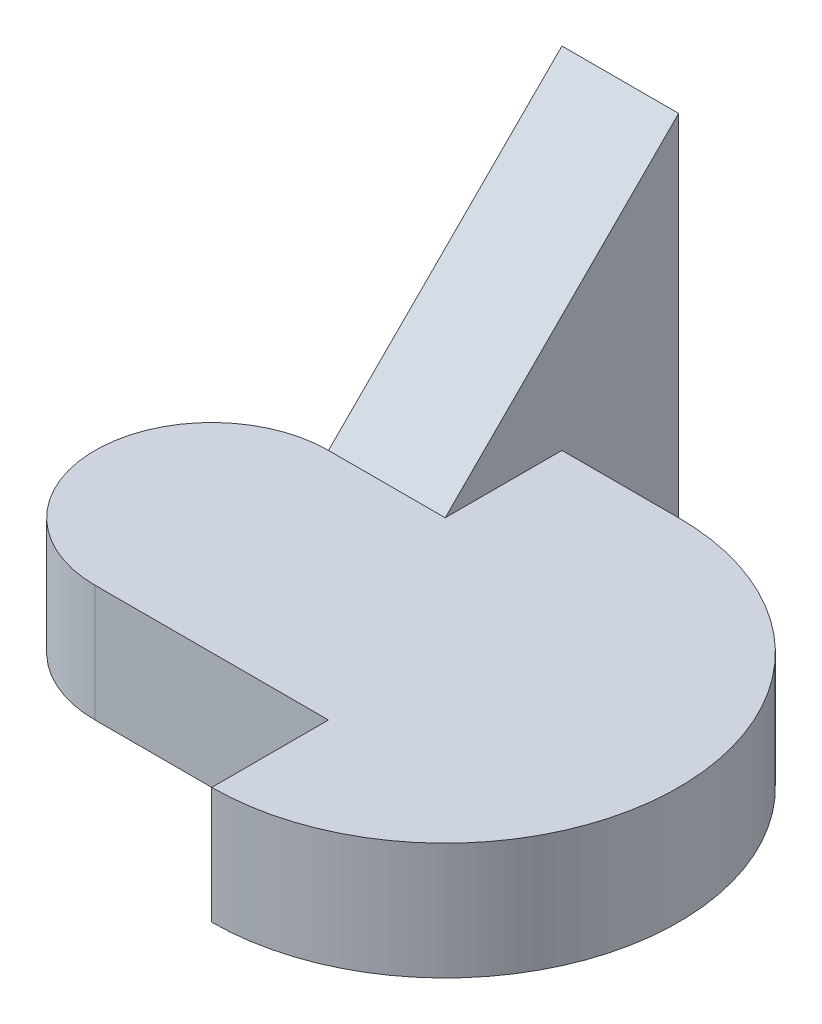
ISO-10303-21;
HEADER;
FILE_DESCRIPTION(('STEP AP214'),'2;1');
FILE_NAME('part.step','',(''),(''),'','','');
FILE_SCHEMA(('AUTOMOTIVE_DESIGN { 1 0 10303 214 1 1 1 1 }'));
ENDSEC;
DATA;
#1=APPLICATION_CONTEXT('core data for automotive mechanical design processes');
#2=APPLICATION_PROTOCOL_DEFINITION('international standard','automotive_design',2000,#1);
#3=PRODUCT_CONTEXT('',#1,'mechanical');
#4=PRODUCT('Part','Part','',(#3));
#5=PRODUCT_RELATED_PRODUCT_CATEGORY('part','',(#4));
#6=PRODUCT_DEFINITION_FORMATION('','',#4);
#7=PRODUCT_DEFINITION_CONTEXT('part definition',#1,'design');
#8=PRODUCT_DEFINITION('design','',#6,#7);
#9=PRODUCT_DEFINITION_SHAPE('','',#8);
#10=(LENGTH_UNIT() NAMED_UNIT(*) SI_UNIT(.MILLI.,.METRE.));
#11=(NAMED_UNIT(*) PLANE_ANGLE_UNIT() SI_UNIT($,.RADIAN.));
#12=(NAMED_UNIT(*) SI_UNIT($,.STERADIAN.) SOLID_ANGLE_UNIT());
#13=UNCERTAINTY_MEASURE_WITH_UNIT(LENGTH_MEASURE(1.E-05),#10,'distance_accuracy_value','');
#14=(GEOMETRIC_REPRESENTATION_CONTEXT(3) GLOBAL_UNCERTAINTY_ASSIGNED_CONTEXT((#13)) GLOBAL_UNIT_ASSIGNED_CONTEXT((#10,
#11,#12)) REPRESENTATION_CONTEXT('',''));
#15=CARTESIAN_POINT('',(0.,0.,0.));
#16=DIRECTION('',(0.,0.,1.));
#17=DIRECTION('',(1.,0.,0.));
#18=AXIS2_PLACEMENT_3D('',#15,#16,#17);
#19=CARTESIAN_POINT('',(0.,5.,0.));
#20=DIRECTION('',(1.,0.,0.));
#21=DIRECTION('',(0.,0.,-1.));
#22=AXIS2_PLACEMENT_3D('',#19,#20,#21);
#23=PLANE('',#22);
#24=DIRECTION('',(0.,0.,1.));
#25=VECTOR('',#24,1.);
#26=CARTESIAN_POINT('',(0.,0.,0.));
#27=LINE('',#26,#25);
#28=CARTESIAN_POINT('',(0.,0.,5.));
#29=VERTEX_POINT('',#28);
#30=CARTESIAN_POINT('',(0.,0.,10.));
#31=VERTEX_POINT('',#30);
#32=EDGE_CURVE('E132',#29,#31,#27,.T.);
#33=ORIENTED_EDGE('',*,*,#32,.T.);
#34=DIRECTION('',(0.,-1.,0.));
#35=VECTOR('',#34,1.);
#36=CARTESIAN_POINT('',(0.,5.,10.));
#37=LINE('',#36,#35);
#38=CARTESIAN_POINT('',(0.,5.,10.));
#39=VERTEX_POINT('',#38);
#40=EDGE_CURVE('E11',#39,#31,#37,.T.);
#41=ORIENTED_EDGE('',*,*,#40,.F.);
#42=DIRECTION('',(0.,0.,1.));
#43=VECTOR('',#42,1.);
#44=CARTESIAN_POINT('',(0.,5.,0.));
#45=LINE('',#44,#43);
#46=CARTESIAN_POINT('',(0.,5.,5.));
#47=VERTEX_POINT('',#46);
#48=EDGE_CURVE('E141',#47,#39,#45,.T.);
#49=ORIENTED_EDGE('',*,*,#48,.F.);
#50=DIRECTION('',(0.,-1.,0.));
#51=VECTOR('',#50,1.);
#52=CARTESIAN_POINT('',(0.,5.,5.));
#53=LINE('',#52,#51);
#54=EDGE_CURVE('E131',#47,#29,#53,.T.);
#55=ORIENTED_EDGE('',*,*,#54,.T.);
#56=EDGE_LOOP('',(#33,#41,#49,#55));
#57=FACE_BOUND('',#56,.T.);
#58=ADVANCED_FACE('F39',(#57),#23,.F.);
#59=CARTESIAN_POINT('',(0.,5.,0.));
#60=DIRECTION('',(0.,-1.,0.));
#61=DIRECTION('',(0.,0.,-1.));
#62=AXIS2_PLACEMENT_3D('',#59,#60,#61);
#63=CYLINDRICAL_SURFACE('',#62,10.);
#64=CARTESIAN_POINT('',(0.,0.,0.));
#65=DIRECTION('',(0.,1.,0.));
#66=DIRECTION('',(0.,0.,1.));
#67=AXIS2_PLACEMENT_3D('',#64,#65,#66);
#68=CIRCLE('',#67,10.);
#69=CARTESIAN_POINT('',(0.,0.,-10.));
#70=VERTEX_POINT('',#69);
#71=EDGE_CURVE('E135',#31,#70,#68,.T.);
#72=ORIENTED_EDGE('',*,*,#71,.T.);
#73=DIRECTION('',(0.,-1.,0.));
#74=VECTOR('',#73,1.);
#75=CARTESIAN_POINT('',(0.,5.,-10.));
#76=LINE('',#75,#74);
#77=CARTESIAN_POINT('',(0.,5.,-10.));
#78=VERTEX_POINT('',#77);
#79=EDGE_CURVE('E47',#78,#70,#76,.T.);
#80=ORIENTED_EDGE('',*,*,#79,.F.);
#81=CARTESIAN_POINT('',(0.,5.,0.));
#82=DIRECTION('',(0.,1.,0.));
#83=DIRECTION('',(0.,0.,1.));
#84=AXIS2_PLACEMENT_3D('',#81,#82,#83);
#85=CIRCLE('',#84,10.);
#86=EDGE_CURVE('E90',#39,#78,#85,.T.);
#87=ORIENTED_EDGE('',*,*,#86,.F.);
#88=ORIENTED_EDGE('',*,*,#40,.T.);
#89=EDGE_LOOP('',(#72,#80,#87,#88));
#90=FACE_BOUND('',#89,.T.);
#91=ADVANCED_FACE('F171',(#90),#63,.T.);
#92=CARTESIAN_POINT('',(0.,5.,-10.));
#93=DIRECTION('',(0.,0.,1.));
#94=DIRECTION('',(1.,0.,0.));
#95=AXIS2_PLACEMENT_3D('',#92,#93,#94);
#96=PLANE('',#95);
#97=DIRECTION('',(-1.,0.,0.));
#98=VECTOR('',#97,1.);
#99=CARTESIAN_POINT('',(0.,0.,-10.));
#100=LINE('',#99,#98);
#101=CARTESIAN_POINT('',(-5.,0.,-10.));
#102=VERTEX_POINT('',#101);
#103=EDGE_CURVE('E112',#70,#102,#100,.T.);
#104=ORIENTED_EDGE('',*,*,#103,.T.);
#105=DIRECTION('',(0.,-1.,0.));
#106=VECTOR('',#105,1.);
#107=CARTESIAN_POINT('',(-5.,5.,-10.));
#108=LINE('',#107,#106);
#109=CARTESIAN_POINT('',(-5.,5.,-10.));
#110=VERTEX_POINT('',#109);
#111=EDGE_CURVE('E109',#110,#102,#108,.T.);
#112=ORIENTED_EDGE('',*,*,#111,.F.);
#113=DIRECTION('',(-1.,0.,0.));
#114=VECTOR('',#113,1.);
#115=CARTESIAN_POINT('',(0.,5.,-10.));
#116=LINE('',#115,#114);
#117=EDGE_CURVE('E98',#78,#110,#116,.T.);
#118=ORIENTED_EDGE('',*,*,#117,.F.);
#119=ORIENTED_EDGE('',*,*,#79,.T.);
#120=EDGE_LOOP('',(#104,#112,#118,#119));
#121=FACE_BOUND('',#120,.T.);
#122=ADVANCED_FACE('F110',(#121),#96,.F.);
#123=CARTESIAN_POINT('',(-10.,5.,0.));
#124=DIRECTION('',(0.,-1.,0.));
#125=DIRECTION('',(0.,0.,-1.));
#126=AXIS2_PLACEMENT_3D('',#123,#124,#125);
#127=CYLINDRICAL_SURFACE('',#126,5.);
#128=CARTESIAN_POINT('',(-10.,0.,0.));
#129=DIRECTION('',(0.,1.,0.));
#130=DIRECTION('',(0.,0.,1.));
#131=AXIS2_PLACEMENT_3D('',#128,#129,#130);
#132=CIRCLE('',#131,5.);
#133=CARTESIAN_POINT('',(-10.,0.,-5.));
#134=VERTEX_POINT('',#133);
#135=CARTESIAN_POINT('',(-10.,0.,5.));
#136=VERTEX_POINT('',#135);
#137=EDGE_CURVE('E76',#134,#136,#132,.T.);
#138=ORIENTED_EDGE('',*,*,#137,.T.);
#139=DIRECTION('',(0.,-1.,0.));
#140=VECTOR('',#139,1.);
#141=CARTESIAN_POINT('',(-10.,5.,5.));
#142=LINE('',#141,#140);
#143=CARTESIAN_POINT('',(-10.,5.,5.));
#144=VERTEX_POINT('',#143);
#145=EDGE_CURVE('E143',#144,#136,#142,.T.);
#146=ORIENTED_EDGE('',*,*,#145,.F.);
#147=CARTESIAN_POINT('',(-10.,5.,0.));
#148=DIRECTION('',(0.,1.,0.));
#149=DIRECTION('',(0.,0.,1.));
#150=AXIS2_PLACEMENT_3D('',#147,#148,#149);
#151=CIRCLE('',#150,5.);
#152=CARTESIAN_POINT('',(-10.,5.,-5.));
#153=VERTEX_POINT('',#152);
#154=EDGE_CURVE('E125',#153,#144,#151,.T.);
#155=ORIENTED_EDGE('',*,*,#154,.F.);
#156=DIRECTION('',(0.,-1.,0.));
#157=VECTOR('',#156,1.);
#158=CARTESIAN_POINT('',(-10.,5.,-5.));
#159=LINE('',#158,#157);
#160=EDGE_CURVE('E116',#153,#134,#159,.T.);
#161=ORIENTED_EDGE('',*,*,#160,.T.);
#162=EDGE_LOOP('',(#138,#146,#155,#161));
#163=FACE_BOUND('',#162,.T.);
#164=ADVANCED_FACE('F177',(#163),#127,.T.);
#165=CARTESIAN_POINT('',(0.,5.,5.));
#166=DIRECTION('',(0.,0.,-1.));
#167=DIRECTION('',(-1.,0.,0.));
#168=AXIS2_PLACEMENT_3D('',#165,#166,#167);
#169=PLANE('',#168);
#170=DIRECTION('',(1.,0.,0.));
#171=VECTOR('',#170,1.);
#172=CARTESIAN_POINT('',(0.,0.,5.));
#173=LINE('',#172,#171);
#174=EDGE_CURVE('E82',#136,#29,#173,.T.);
#175=ORIENTED_EDGE('',*,*,#174,.T.);
#176=ORIENTED_EDGE('',*,*,#54,.F.);
#177=DIRECTION('',(1.,0.,0.));
#178=VECTOR('',#177,1.);
#179=CARTESIAN_POINT('',(0.,5.,5.));
#180=LINE('',#179,#178);
#181=EDGE_CURVE('E55',#144,#47,#180,.T.);
#182=ORIENTED_EDGE('',*,*,#181,.F.);
#183=ORIENTED_EDGE('',*,*,#145,.T.);
#184=EDGE_LOOP('',(#175,#176,#182,#183));
#185=FACE_BOUND('',#184,.T.);
#186=ADVANCED_FACE('F182',(#185),#169,.F.);
#187=CARTESIAN_POINT('',(0.,5.,0.));
#188=DIRECTION('',(0.,1.,0.));
#189=DIRECTION('',(0.,0.,1.));
#190=AXIS2_PLACEMENT_3D('',#187,#188,#189);
#191=PLANE('',#190);
#192=DIRECTION('',(0.,0.,1.));
#193=VECTOR('',#192,1.);
#194=CARTESIAN_POINT('',(-5.,5.,0.));
#195=LINE('',#194,#193);
#196=CARTESIAN_POINT('',(-5.,5.,-5.));
#197=VERTEX_POINT('',#196);
#198=EDGE_CURVE('E104',#110,#197,#195,.T.);
#199=ORIENTED_EDGE('',*,*,#198,.T.);
#200=DIRECTION('',(-1.,0.,0.));
#201=VECTOR('',#200,1.);
#202=CARTESIAN_POINT('',(0.,5.,-5.));
#203=LINE('',#202,#201);
#204=EDGE_CURVE('E123',#197,#153,#203,.T.);
#205=ORIENTED_EDGE('',*,*,#204,.T.);
#206=ORIENTED_EDGE('',*,*,#154,.T.);
#207=ORIENTED_EDGE('',*,*,#181,.T.);
#208=ORIENTED_EDGE('',*,*,#48,.T.);
#209=ORIENTED_EDGE('',*,*,#86,.T.);
#210=ORIENTED_EDGE('',*,*,#117,.T.);
#211=EDGE_LOOP('',(#199,#205,#206,#207,#208,#209,#210));
#212=FACE_BOUND('',#211,.T.);
#213=ADVANCED_FACE('F100',(#212),#191,.T.);
#214=CARTESIAN_POINT('',(0.,0.,0.));
#215=DIRECTION('',(0.,1.,0.));
#216=DIRECTION('',(0.,0.,1.));
#217=AXIS2_PLACEMENT_3D('',#214,#215,#216);
#218=PLANE('',#217);
#219=ORIENTED_EDGE('',*,*,#32,.F.);
#220=ORIENTED_EDGE('',*,*,#174,.F.);
#221=ORIENTED_EDGE('',*,*,#137,.F.);
#222=DIRECTION('',(0.,0.,-1.));
#223=VECTOR('',#222,1.);
#224=CARTESIAN_POINT('',(-10.,0.,0.));
#225=LINE('',#224,#223);
#226=CARTESIAN_POINT('',(-10.,0.,-15.));
#227=VERTEX_POINT('',#226);
#228=EDGE_CURVE('E155',#134,#227,#225,.T.);
#229=ORIENTED_EDGE('',*,*,#228,.T.);
#230=DIRECTION('',(1.,0.,0.));
#231=VECTOR('',#230,1.);
#232=CARTESIAN_POINT('',(0.,0.,-15.));
#233=LINE('',#232,#231);
#234=CARTESIAN_POINT('',(-5.,0.,-15.));
#235=VERTEX_POINT('',#234);
#236=EDGE_CURVE('E153',#227,#235,#233,.T.);
#237=ORIENTED_EDGE('',*,*,#236,.T.);
#238=DIRECTION('',(0.,0.,1.));
#239=VECTOR('',#238,1.);
#240=CARTESIAN_POINT('',(-5.,0.,0.));
#241=LINE('',#240,#239);
#242=EDGE_CURVE('E149',#235,#102,#241,.T.);
#243=ORIENTED_EDGE('',*,*,#242,.T.);
#244=ORIENTED_EDGE('',*,*,#103,.F.);
#245=ORIENTED_EDGE('',*,*,#71,.F.);
#246=EDGE_LOOP('',(#219,#220,#221,#229,#237,#243,#244,#245));
#247=FACE_BOUND('',#246,.T.);
#248=ADVANCED_FACE('F147',(#247),#218,.F.);
#249=CARTESIAN_POINT('',(-5.,15.,0.));
#250=DIRECTION('',(1.,0.,0.));
#251=DIRECTION('',(0.,0.,-1.));
#252=AXIS2_PLACEMENT_3D('',#249,#250,#251);
#253=PLANE('',#252);
#254=DIRECTION('',(0.,0.707106781186547,-0.707106781186548));
#255=VECTOR('',#254,1.);
#256=CARTESIAN_POINT('',(-5.,7.5,-7.5));
#257=LINE('',#256,#255);
#258=CARTESIAN_POINT('',(-5.,15.,-15.));
#259=VERTEX_POINT('',#258);
#260=EDGE_CURVE('E122',#197,#259,#257,.T.);
#261=ORIENTED_EDGE('',*,*,#260,.F.);
#262=ORIENTED_EDGE('',*,*,#198,.F.);
#263=ORIENTED_EDGE('',*,*,#111,.T.);
#264=ORIENTED_EDGE('',*,*,#242,.F.);
#265=DIRECTION('',(0.,-1.,0.));
#266=VECTOR('',#265,1.);
#267=CARTESIAN_POINT('',(-5.,15.,-15.));
#268=LINE('',#267,#266);
#269=EDGE_CURVE('E136',#259,#235,#268,.T.);
#270=ORIENTED_EDGE('',*,*,#269,.F.);
#271=EDGE_LOOP('',(#261,#262,#263,#264,#270));
#272=FACE_BOUND('',#271,.T.);
#273=ADVANCED_FACE('F119',(#272),#253,.T.);
#274=CARTESIAN_POINT('',(0.,15.,-15.));
#275=DIRECTION('',(0.,0.,-1.));
#276=DIRECTION('',(-1.,0.,0.));
#277=AXIS2_PLACEMENT_3D('',#274,#275,#276);
#278=PLANE('',#277);
#279=ORIENTED_EDGE('',*,*,#236,.F.);
#280=DIRECTION('',(0.,-1.,0.));
#281=VECTOR('',#280,1.);
#282=CARTESIAN_POINT('',(-10.,15.,-15.));
#283=LINE('',#282,#281);
#284=CARTESIAN_POINT('',(-10.,15.,-15.));
#285=VERTEX_POINT('',#284);
#286=EDGE_CURVE('E163',#285,#227,#283,.T.);
#287=ORIENTED_EDGE('',*,*,#286,.F.);
#288=DIRECTION('',(1.,0.,0.));
#289=VECTOR('',#288,1.);
#290=CARTESIAN_POINT('',(0.,15.,-15.));
#291=LINE('',#290,#289);
#292=EDGE_CURVE('E160',#285,#259,#291,.T.);
#293=ORIENTED_EDGE('',*,*,#292,.T.);
#294=ORIENTED_EDGE('',*,*,#269,.T.);
#295=EDGE_LOOP('',(#279,#287,#293,#294));
#296=FACE_BOUND('',#295,.T.);
#297=ADVANCED_FACE('F191',(#296),#278,.T.);
#298=CARTESIAN_POINT('',(-10.,15.,0.));
#299=DIRECTION('',(-1.,0.,0.));
#300=DIRECTION('',(0.,0.,1.));
#301=AXIS2_PLACEMENT_3D('',#298,#299,#300);
#302=PLANE('',#301);
#303=DIRECTION('',(0.,-0.707106781186547,0.707106781186548));
#304=VECTOR('',#303,1.);
#305=CARTESIAN_POINT('',(-10.,15.,-15.));
#306=LINE('',#305,#304);
#307=EDGE_CURVE('E157',#285,#153,#306,.T.);
#308=ORIENTED_EDGE('',*,*,#307,.F.);
#309=ORIENTED_EDGE('',*,*,#286,.T.);
#310=ORIENTED_EDGE('',*,*,#228,.F.);
#311=ORIENTED_EDGE('',*,*,#160,.F.);
#312=EDGE_LOOP('',(#308,#309,#310,#311));
#313=FACE_BOUND('',#312,.T.);
#314=ADVANCED_FACE('F194',(#313),#302,.T.);
#315=CARTESIAN_POINT('',(5.,15.,-15.));
#316=DIRECTION('',(0.,-0.707106781186548,-0.707106781186547));
#317=DIRECTION('',(0.,0.707106781186547,-0.707106781186548));
#318=AXIS2_PLACEMENT_3D('',#315,#316,#317);
#319=PLANE('',#318);
#320=ORIENTED_EDGE('',*,*,#260,.T.);
#321=ORIENTED_EDGE('',*,*,#292,.F.);
#322=ORIENTED_EDGE('',*,*,#307,.T.);
#323=ORIENTED_EDGE('',*,*,#204,.F.);
#324=EDGE_LOOP('',(#320,#321,#322,#323));
#325=FACE_BOUND('',#324,.T.);
#326=ADVANCED_FACE('F198',(#325),#319,.F.);
#327=CLOSED_SHELL('',(#58,#91,#122,#164,#186,#213,#248,#273,#297,#314,#326));
#328=MANIFOLD_SOLID_BREP('B2',#327);
#329=ADVANCED_BREP_SHAPE_REPRESENTATION('',(#18,#328),#14);
#330=SHAPE_DEFINITION_REPRESENTATION(#9,#329);
ENDSEC;
END-ISO-10303-21;
